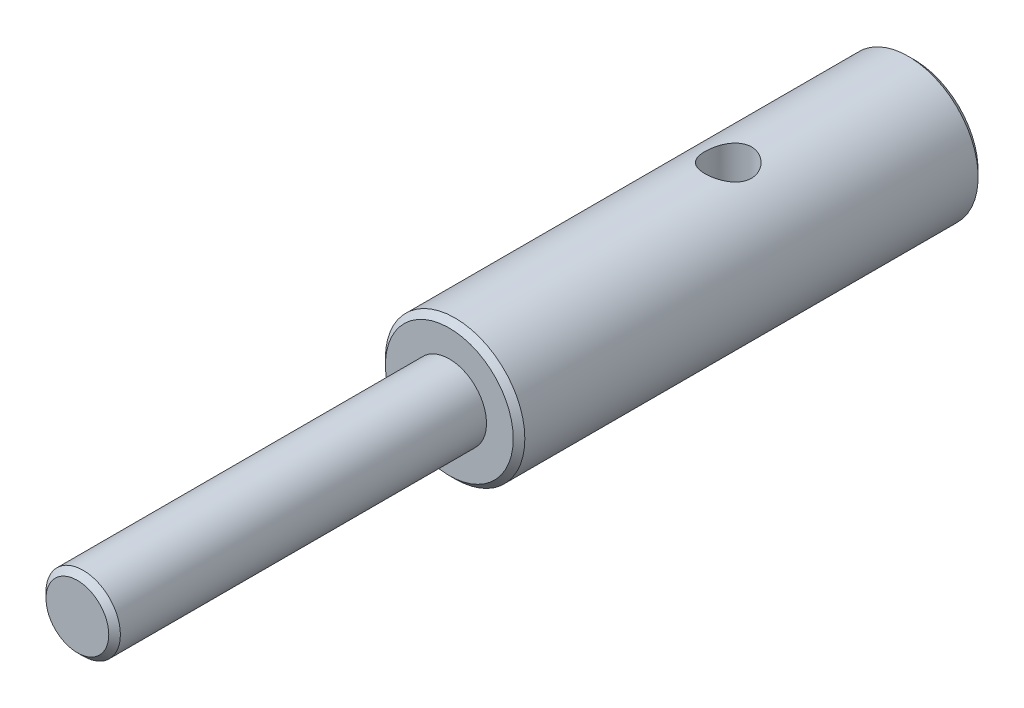
ISO-10303-21;
HEADER;
FILE_DESCRIPTION(('STEP AP214'),'2;1');
FILE_NAME('part.step','',(''),(''),'','','');
FILE_SCHEMA(('AUTOMOTIVE_DESIGN { 1 0 10303 214 1 1 1 1 }'));
ENDSEC;
DATA;
#1=APPLICATION_CONTEXT('core data for automotive mechanical design processes');
#2=APPLICATION_PROTOCOL_DEFINITION('international standard','automotive_design',2000,#1);
#3=PRODUCT_CONTEXT('',#1,'mechanical');
#4=PRODUCT('Part','Part','',(#3));
#5=PRODUCT_RELATED_PRODUCT_CATEGORY('part','',(#4));
#6=PRODUCT_DEFINITION_FORMATION('','',#4);
#7=PRODUCT_DEFINITION_CONTEXT('part definition',#1,'design');
#8=PRODUCT_DEFINITION('design','',#6,#7);
#9=PRODUCT_DEFINITION_SHAPE('','',#8);
#10=(LENGTH_UNIT() NAMED_UNIT(*) SI_UNIT(.MILLI.,.METRE.));
#11=(NAMED_UNIT(*) PLANE_ANGLE_UNIT() SI_UNIT($,.RADIAN.));
#12=(NAMED_UNIT(*) SI_UNIT($,.STERADIAN.) SOLID_ANGLE_UNIT());
#13=UNCERTAINTY_MEASURE_WITH_UNIT(LENGTH_MEASURE(1.E-05),#10,'distance_accuracy_value','');
#14=(GEOMETRIC_REPRESENTATION_CONTEXT(3) GLOBAL_UNCERTAINTY_ASSIGNED_CONTEXT((#13)) GLOBAL_UNIT_ASSIGNED_CONTEXT((#10,
#11,#12)) REPRESENTATION_CONTEXT('',''));
#15=CARTESIAN_POINT('',(0.,0.,0.));
#16=DIRECTION('',(0.,0.,1.));
#17=DIRECTION('',(1.,0.,0.));
#18=AXIS2_PLACEMENT_3D('',#15,#16,#17);
#19=CARTESIAN_POINT('',(0.,0.,0.));
#20=DIRECTION('',(0.,0.,-1.));
#21=DIRECTION('',(-1.,0.,0.));
#22=AXIS2_PLACEMENT_3D('',#19,#20,#21);
#23=CYLINDRICAL_SURFACE('',#22,3.);
#24=CARTESIAN_POINT('',(0.,0.,-9.75));
#25=DIRECTION('',(0.,0.,-1.));
#26=DIRECTION('',(-1.,0.,0.));
#27=AXIS2_PLACEMENT_3D('',#24,#25,#26);
#28=CIRCLE('',#27,3.);
#29=CARTESIAN_POINT('',(-3.,0.,-9.75));
#30=VERTEX_POINT('',#29);
#31=EDGE_CURVE('E48',#30,#30,#28,.F.);
#32=ORIENTED_EDGE('',*,*,#31,.T.);
#33=EDGE_LOOP('',(#32));
#34=FACE_BOUND('',#33,.T.);
#35=CARTESIAN_POINT('',(0.,0.,9.75));
#36=DIRECTION('',(0.,0.,1.));
#37=DIRECTION('',(1.,0.,0.));
#38=AXIS2_PLACEMENT_3D('',#35,#36,#37);
#39=CIRCLE('',#38,3.);
#40=CARTESIAN_POINT('',(3.,0.,9.75));
#41=VERTEX_POINT('',#40);
#42=EDGE_CURVE('E80',#41,#41,#39,.F.);
#43=ORIENTED_EDGE('',*,*,#42,.T.);
#44=EDGE_LOOP('',(#43));
#45=FACE_BOUND('',#44,.T.);
#46=CARTESIAN_POINT('',(0.,3.,-3.));
#47=CARTESIAN_POINT('',(0.0545633628867242,3.00000015300943,-3.00000025373164));
#48=CARTESIAN_POINT('',(0.109125194538551,2.99849769507545,-2.99551973387278));
#49=CARTESIAN_POINT('',(0.216641760872973,2.99265210203281,-2.97777089118278));
#50=CARTESIAN_POINT('',(0.269596328118819,2.98830867202153,-2.96450165605108));
#51=CARTESIAN_POINT('',(0.372332789501777,2.97725307906443,-2.92968075661595));
#52=CARTESIAN_POINT('',(0.422119825886035,2.97054487730853,-2.90814293754073));
#53=CARTESIAN_POINT('',(0.517374936805325,2.95544445717342,-2.85745882716165));
#54=CARTESIAN_POINT('',(0.562842156958706,2.94705190667778,-2.8283110349974));
#55=CARTESIAN_POINT('',(0.649741675022267,2.92914094443005,-2.76217419514125));
#56=CARTESIAN_POINT('',(0.69100370029831,2.91959556463785,-2.72496876573951));
#57=CARTESIAN_POINT('',(0.766832692702085,2.90060314783121,-2.64423284529343));
#58=CARTESIAN_POINT('',(0.801398185489463,2.89115613290549,-2.60070096507149));
#59=CARTESIAN_POINT('',(0.86382494222786,2.87313332477274,-2.50701488480354));
#60=CARTESIAN_POINT('',(0.891464858221033,2.86459039275688,-2.45670626026788));
#61=CARTESIAN_POINT('',(0.937818873877722,2.84975305418601,-2.35182390554145));
#62=CARTESIAN_POINT('',(0.956535697386766,2.84345796160746,-2.29725148283726));
#63=CARTESIAN_POINT('',(0.983873461509164,2.83411303269377,-2.18732677850329));
#64=CARTESIAN_POINT('',(0.99281344827177,2.83096095769611,-2.13206279151094));
#65=CARTESIAN_POINT('',(1.00134112333448,2.82795656629508,-2.02073624584412));
#66=CARTESIAN_POINT('',(1.00093170160472,2.8281032302273,-1.96467393929081));
#67=CARTESIAN_POINT('',(0.99101990370342,2.8315901500818,-1.85606336955598));
#68=CARTESIAN_POINT('',(0.981933913166996,2.83478415867533,-1.80347159708098));
#69=CARTESIAN_POINT('',(0.955606162849418,2.84376657724551,-1.70060658039317));
#70=CARTESIAN_POINT('',(0.938363426591872,2.84955529784108,-1.65033361456493));
#71=CARTESIAN_POINT('',(0.895939058060212,2.86317911131249,-1.55258725040852));
#72=CARTESIAN_POINT('',(0.870634048707264,2.87104565793117,-1.50517197453047));
#73=CARTESIAN_POINT('',(0.81288910630314,2.88792558575726,-1.41512909172027));
#74=CARTESIAN_POINT('',(0.780447112364007,2.89693929790464,-1.37250287306662));
#75=CARTESIAN_POINT('',(0.707349332682239,2.91567329167741,-1.29090840183923));
#76=CARTESIAN_POINT('',(0.666353150076313,2.92540589354843,-1.25224730549093));
#77=CARTESIAN_POINT('',(0.578339569970065,2.94406938387037,-1.1822687333366));
#78=CARTESIAN_POINT('',(0.531321595660816,2.95300019538067,-1.1509519618355));
#79=CARTESIAN_POINT('',(0.431947613046269,2.96917107937794,-1.09630369976493));
#80=CARTESIAN_POINT('',(0.379543276416338,2.97639350008039,-1.07305450865927));
#81=CARTESIAN_POINT('',(0.271269083364509,2.98820567144435,-1.03579682604429));
#82=CARTESIAN_POINT('',(0.215400438154955,2.99279633654878,-1.02178512457656));
#83=CARTESIAN_POINT('',(0.104383829529305,2.99867627071441,-1.00394433397764));
#84=CARTESIAN_POINT('',(0.0493095998648469,3.00010001833731,-0.999700190827251));
#85=CARTESIAN_POINT('',(-0.0607750699602348,2.99988902694825,-1.00033267359847));
#86=CARTESIAN_POINT('',(-0.115785519319645,2.99825480419352,-1.00520775997987));
#87=CARTESIAN_POINT('',(-0.222519866304258,2.99220024717114,-1.02361190773597));
#88=CARTESIAN_POINT('',(-0.274292806834855,2.98786198711228,-1.03688620604952));
#89=CARTESIAN_POINT('',(-0.374855958579559,2.97691846830034,-1.0713934444667));
#90=CARTESIAN_POINT('',(-0.423645788508558,2.97031292046541,-1.09262739946767));
#91=CARTESIAN_POINT('',(-0.51828829639332,2.95528931287427,-1.1430704318409));
#92=CARTESIAN_POINT('',(-0.564029959217328,2.94682814756305,-1.1724745932836));
#93=CARTESIAN_POINT('',(-0.650064830135403,2.92905253915743,-1.23819415001305));
#94=CARTESIAN_POINT('',(-0.690356367794893,2.91973783591888,-1.27451165603016));
#95=CARTESIAN_POINT('',(-0.766252507807012,2.90076847982472,-1.35497875100826));
#96=CARTESIAN_POINT('',(-0.80156096924849,2.89111761095155,-1.39940922693325));
#97=CARTESIAN_POINT('',(-0.864257522320852,2.87299973286981,-1.4937715678045));
#98=CARTESIAN_POINT('',(-0.891645547920842,2.8645327335312,-1.5437034786102));
#99=CARTESIAN_POINT('',(-0.937596930423359,2.84982391820308,-1.64767301530659));
#100=CARTESIAN_POINT('',(-0.956178132197765,2.84357760900632,-1.70170207924278));
#101=CARTESIAN_POINT('',(-0.983894666792162,2.83410832399133,-1.81237865012415));
#102=CARTESIAN_POINT('',(-0.993034254961242,2.83088398622698,-1.86902496543306));
#103=CARTESIAN_POINT('',(-1.00127628247038,2.82797858875071,-1.98019709601321));
#104=CARTESIAN_POINT('',(-1.00087025731093,2.82812400344299,-2.03468234025174));
#105=CARTESIAN_POINT('',(-0.991242293454877,2.8315126992356,-2.14276507489974));
#106=CARTESIAN_POINT('',(-0.982020879458886,2.83475579595884,-2.19636261795291));
#107=CARTESIAN_POINT('',(-0.95537181312698,2.84384524278943,-2.30013566301267));
#108=CARTESIAN_POINT('',(-0.938103346014879,2.84964098015514,-2.35035682500723));
#109=CARTESIAN_POINT('',(-0.895979365760381,2.86316398825434,-2.44722740693553));
#110=CARTESIAN_POINT('',(-0.871122168553978,2.87089168765297,-2.49387603118726));
#111=CARTESIAN_POINT('',(-0.813260692583248,2.8878282922406,-2.58448366992369));
#112=CARTESIAN_POINT('',(-0.779948242764531,2.89708711641604,-2.62823650189859));
#113=CARTESIAN_POINT('',(-0.706642883135696,2.91583356283786,-2.70968981338399));
#114=CARTESIAN_POINT('',(-0.666648084451494,2.92532124912518,-2.74738857568802));
#115=CARTESIAN_POINT('',(-0.579241556920673,2.94390030525393,-2.81714441228924));
#116=CARTESIAN_POINT('',(-0.531601513499724,2.95296181801216,-2.84892434775102));
#117=CARTESIAN_POINT('',(-0.431357357406628,2.96925991172652,-2.90399042885063));
#118=CARTESIAN_POINT('',(-0.378754518132349,2.9764969590794,-2.92727874592204));
#119=CARTESIAN_POINT('',(-0.272493647200975,2.98805515068532,-2.96372163248868));
#120=CARTESIAN_POINT('',(-0.218987757676408,2.9924921242252,-2.97728246626338));
#121=CARTESIAN_POINT('',(-0.110320416010247,2.99846407064225,-2.99542028067713));
#122=CARTESIAN_POINT('',(-0.0551594255687456,2.99999984531906,-2.99999974349654));
#123=CARTESIAN_POINT('',(0.,3.,-3.));
#124=B_SPLINE_CURVE_WITH_KNOTS('',3,(#46,#47,#48,#49,#50,#51,#52,#53,#54,#55,#56,#57,#58,#59,
#60,#61,#62,#63,#64,#65,#66,#67,#68,#69,#70,#71,#72,#73,#74,#75,#76,#77,#78,#79,#80,#81,#82,#83,
#84,#85,#86,#87,#88,#89,#90,#91,#92,#93,#94,#95,#96,#97,#98,#99,#100,#101,#102,#103,#104,#105,
#106,#107,#108,#109,#110,#111,#112,#113,#114,#115,#116,#117,#118,#119,#120,#121,#122,#123),
.UNSPECIFIED.,.T.,.F.,(4,2,2,2,2,2,2,2,2,2,2,2,2,2,2,2,2,2,2,2,2,2,2,2,2,2,2,2,2,2,2,2,2,2,2,2,
2,2,4),(0.,0.163487106026011,0.326991185267521,0.490222672870273,0.6534863777991,
0.82184684282756,0.990244332875302,1.1634838482347,1.33667044692833,1.5040192574184,
1.67131633987485,1.8309682655128,1.99063930855482,2.15288171155131,2.31517102558207,
2.48593305811367,2.65671145966618,2.82918405650357,3.00159668877208,3.1665358317517,
3.33144713164177,3.49158157978213,3.65173645284104,3.81610399843736,3.98052180821891,
4.15241022880752,4.32430008234997,4.49584013824416,4.66730284700846,4.82995666056619,
4.99260079341185,5.15215587070227,5.31174638165787,5.47830066681615,5.64490211113589,
5.8179966082491,5.99104681142266,6.15636558363623,6.3216386602795),.UNSPECIFIED.);
#125=CARTESIAN_POINT('',(0.,3.,-3.));
#126=VERTEX_POINT('',#125);
#127=EDGE_CURVE('E108',#126,#126,#124,.T.);
#128=ORIENTED_EDGE('',*,*,#127,.T.);
#129=EDGE_LOOP('',(#128));
#130=FACE_BOUND('',#129,.T.);
#131=ADVANCED_FACE('F39',(#34,#45,#130),#23,.T.);
#132=CARTESIAN_POINT('',(0.,0.,0.));
#133=DIRECTION('',(0.,0.,-1.));
#134=DIRECTION('',(-1.,0.,0.));
#135=AXIS2_PLACEMENT_3D('',#132,#133,#134);
#136=CYLINDRICAL_SURFACE('',#135,1.);
#137=CARTESIAN_POINT('',(0.,0.,0.));
#138=DIRECTION('',(0.,0.,-1.));
#139=DIRECTION('',(-1.,0.,0.));
#140=AXIS2_PLACEMENT_3D('',#137,#138,#139);
#141=CIRCLE('',#140,1.);
#142=CARTESIAN_POINT('',(-1.,0.,0.));
#143=VERTEX_POINT('',#142);
#144=EDGE_CURVE('E104',#143,#143,#141,.T.);
#145=ORIENTED_EDGE('',*,*,#144,.F.);
#146=EDGE_LOOP('',(#145));
#147=FACE_BOUND('',#146,.T.);
#148=CARTESIAN_POINT('',(0.,0.,-10.));
#149=DIRECTION('',(0.,0.,-1.));
#150=DIRECTION('',(-1.,0.,0.));
#151=AXIS2_PLACEMENT_3D('',#148,#149,#150);
#152=CIRCLE('',#151,1.);
#153=CARTESIAN_POINT('',(-1.,0.,-10.));
#154=VERTEX_POINT('',#153);
#155=EDGE_CURVE('E102',#154,#154,#152,.T.);
#156=ORIENTED_EDGE('',*,*,#155,.T.);
#157=EDGE_LOOP('',(#156));
#158=FACE_BOUND('',#157,.T.);
#159=CARTESIAN_POINT('',(0.,0.,-2.));
#160=DIRECTION('',(0.,0.707106781186547,-0.707106781186547));
#161=DIRECTION('',(0.,-0.707106781186547,-0.707106781186547));
#162=AXIS2_PLACEMENT_3D('',#159,#160,#161);
#163=ELLIPSE('',#162,1.41421356237309,1.);
#164=CARTESIAN_POINT('',(-1.,0.,-2.));
#165=VERTEX_POINT('',#164);
#166=CARTESIAN_POINT('',(1.,0.,-2.));
#167=VERTEX_POINT('',#166);
#168=EDGE_CURVE('E58',#165,#167,#163,.T.);
#169=ORIENTED_EDGE('',*,*,#168,.T.);
#170=CARTESIAN_POINT('',(0.,0.,-2.));
#171=DIRECTION('',(0.,-0.707106781186547,-0.707106781186547));
#172=DIRECTION('',(0.,0.707106781186547,-0.707106781186547));
#173=AXIS2_PLACEMENT_3D('',#170,#171,#172);
#174=ELLIPSE('',#173,1.41421356237309,1.);
#175=EDGE_CURVE('E56',#167,#165,#174,.F.);
#176=ORIENTED_EDGE('',*,*,#175,.T.);
#177=EDGE_LOOP('',(#169,#176));
#178=FACE_BOUND('',#177,.T.);
#179=ADVANCED_FACE('F64',(#147,#158,#178),#136,.F.);
#180=CARTESIAN_POINT('',(0.,1.,0.));
#181=DIRECTION('',(0.,0.,-1.));
#182=DIRECTION('',(-1.,0.,0.));
#183=AXIS2_PLACEMENT_3D('',#180,#181,#182);
#184=PLANE('',#183);
#185=ORIENTED_EDGE('',*,*,#144,.T.);
#186=EDGE_LOOP('',(#185));
#187=FACE_BOUND('',#186,.T.);
#188=ADVANCED_FACE('F123',(#187),#184,.T.);
#189=CARTESIAN_POINT('',(0.,0.,26.));
#190=DIRECTION('',(0.,0.,1.));
#191=DIRECTION('',(1.,0.,0.));
#192=AXIS2_PLACEMENT_3D('',#189,#190,#191);
#193=PLANE('',#192);
#194=CARTESIAN_POINT('',(0.,0.,26.));
#195=DIRECTION('',(0.,0.,1.));
#196=DIRECTION('',(1.,0.,0.));
#197=AXIS2_PLACEMENT_3D('',#194,#195,#196);
#198=CIRCLE('',#197,1.35);
#199=CARTESIAN_POINT('',(1.35,0.,26.));
#200=VERTEX_POINT('',#199);
#201=EDGE_CURVE('E70',#200,#200,#198,.T.);
#202=ORIENTED_EDGE('',*,*,#201,.T.);
#203=EDGE_LOOP('',(#202));
#204=FACE_BOUND('',#203,.T.);
#205=ADVANCED_FACE('F129',(#204),#193,.T.);
#206=CARTESIAN_POINT('',(0.,0.,0.));
#207=DIRECTION('',(0.,0.,-1.));
#208=DIRECTION('',(-1.,0.,0.));
#209=AXIS2_PLACEMENT_3D('',#206,#207,#208);
#210=CYLINDRICAL_SURFACE('',#209,1.6);
#211=CARTESIAN_POINT('',(0.,0.,25.75));
#212=DIRECTION('',(0.,0.,1.));
#213=DIRECTION('',(1.,0.,0.));
#214=AXIS2_PLACEMENT_3D('',#211,#212,#213);
#215=CIRCLE('',#214,1.6);
#216=CARTESIAN_POINT('',(1.6,0.,25.75));
#217=VERTEX_POINT('',#216);
#218=EDGE_CURVE('E66',#217,#217,#215,.F.);
#219=ORIENTED_EDGE('',*,*,#218,.T.);
#220=EDGE_LOOP('',(#219));
#221=FACE_BOUND('',#220,.T.);
#222=CARTESIAN_POINT('',(0.,0.,10.));
#223=DIRECTION('',(0.,0.,-1.));
#224=DIRECTION('',(-1.,0.,0.));
#225=AXIS2_PLACEMENT_3D('',#222,#223,#224);
#226=CIRCLE('',#225,1.6);
#227=CARTESIAN_POINT('',(-1.6,0.,10.));
#228=VERTEX_POINT('',#227);
#229=EDGE_CURVE('E62',#228,#228,#226,.T.);
#230=ORIENTED_EDGE('',*,*,#229,.F.);
#231=EDGE_LOOP('',(#230));
#232=FACE_BOUND('',#231,.T.);
#233=ADVANCED_FACE('F189',(#221,#232),#210,.T.);
#234=CARTESIAN_POINT('',(0.,1.6,10.));
#235=DIRECTION('',(0.,0.,1.));
#236=DIRECTION('',(1.,0.,0.));
#237=AXIS2_PLACEMENT_3D('',#234,#235,#236);
#238=PLANE('',#237);
#239=CARTESIAN_POINT('',(0.,0.,10.));
#240=DIRECTION('',(0.,0.,1.));
#241=DIRECTION('',(1.,0.,0.));
#242=AXIS2_PLACEMENT_3D('',#239,#240,#241);
#243=CIRCLE('',#242,2.75);
#244=CARTESIAN_POINT('',(2.75,0.,10.));
#245=VERTEX_POINT('',#244);
#246=EDGE_CURVE('E11',#245,#245,#243,.T.);
#247=ORIENTED_EDGE('',*,*,#246,.T.);
#248=EDGE_LOOP('',(#247));
#249=FACE_BOUND('',#248,.T.);
#250=ORIENTED_EDGE('',*,*,#229,.T.);
#251=EDGE_LOOP('',(#250));
#252=FACE_BOUND('',#251,.T.);
#253=ADVANCED_FACE('F98',(#249,#252),#238,.T.);
#254=CARTESIAN_POINT('',(0.,1.,-10.));
#255=DIRECTION('',(0.,0.,-1.));
#256=DIRECTION('',(-1.,0.,0.));
#257=AXIS2_PLACEMENT_3D('',#254,#255,#256);
#258=PLANE('',#257);
#259=CARTESIAN_POINT('',(0.,0.,-10.));
#260=DIRECTION('',(0.,0.,-1.));
#261=DIRECTION('',(-1.,0.,0.));
#262=AXIS2_PLACEMENT_3D('',#259,#260,#261);
#263=CIRCLE('',#262,2.75000000000001);
#264=CARTESIAN_POINT('',(-2.75000000000001,0.,-10.));
#265=VERTEX_POINT('',#264);
#266=EDGE_CURVE('E76',#265,#265,#263,.T.);
#267=ORIENTED_EDGE('',*,*,#266,.T.);
#268=EDGE_LOOP('',(#267));
#269=FACE_BOUND('',#268,.T.);
#270=ORIENTED_EDGE('',*,*,#155,.F.);
#271=EDGE_LOOP('',(#270));
#272=FACE_BOUND('',#271,.T.);
#273=ADVANCED_FACE('F95',(#269,#272),#258,.T.);
#274=CARTESIAN_POINT('',(0.,3.,-2.));
#275=DIRECTION('',(0.,-1.,0.));
#276=DIRECTION('',(0.,0.,-1.));
#277=AXIS2_PLACEMENT_3D('',#274,#275,#276);
#278=CYLINDRICAL_SURFACE('',#277,1.);
#279=ORIENTED_EDGE('',*,*,#127,.F.);
#280=EDGE_LOOP('',(#279));
#281=FACE_BOUND('',#280,.T.);
#282=ORIENTED_EDGE('',*,*,#168,.F.);
#283=ORIENTED_EDGE('',*,*,#175,.F.);
#284=EDGE_LOOP('',(#282,#283));
#285=FACE_BOUND('',#284,.T.);
#286=ADVANCED_FACE('F59',(#281,#285),#278,.F.);
#287=CARTESIAN_POINT('',(0.,0.,25.75));
#288=DIRECTION('',(0.,0.,-1.));
#289=DIRECTION('',(-1.,0.,0.));
#290=AXIS2_PLACEMENT_3D('',#287,#288,#289);
#291=CONICAL_SURFACE('',#290,1.6,0.785398163397442);
#292=ORIENTED_EDGE('',*,*,#201,.F.);
#293=EDGE_LOOP('',(#292));
#294=FACE_BOUND('',#293,.T.);
#295=ORIENTED_EDGE('',*,*,#218,.F.);
#296=EDGE_LOOP('',(#295));
#297=FACE_BOUND('',#296,.T.);
#298=ADVANCED_FACE('F92',(#294,#297),#291,.T.);
#299=CARTESIAN_POINT('',(0.,0.,-10.));
#300=DIRECTION('',(0.,0.,1.));
#301=DIRECTION('',(1.,0.,0.));
#302=AXIS2_PLACEMENT_3D('',#299,#300,#301);
#303=CONICAL_SURFACE('',#302,2.75000000000001,0.785398163397441);
#304=ORIENTED_EDGE('',*,*,#31,.F.);
#305=EDGE_LOOP('',(#304));
#306=FACE_BOUND('',#305,.T.);
#307=ORIENTED_EDGE('',*,*,#266,.F.);
#308=EDGE_LOOP('',(#307));
#309=FACE_BOUND('',#308,.T.);
#310=ADVANCED_FACE('F89',(#306,#309),#303,.T.);
#311=CARTESIAN_POINT('',(0.,0.,9.75));
#312=DIRECTION('',(0.,0.,-1.));
#313=DIRECTION('',(-1.,0.,0.));
#314=AXIS2_PLACEMENT_3D('',#311,#312,#313);
#315=CONICAL_SURFACE('',#314,3.,0.785398163397453);
#316=ORIENTED_EDGE('',*,*,#246,.F.);
#317=EDGE_LOOP('',(#316));
#318=FACE_BOUND('',#317,.T.);
#319=ORIENTED_EDGE('',*,*,#42,.F.);
#320=EDGE_LOOP('',(#319));
#321=FACE_BOUND('',#320,.T.);
#322=ADVANCED_FACE('F41',(#318,#321),#315,.T.);
#323=CLOSED_SHELL('',(#131,#179,#188,#205,#233,#253,#273,#286,#298,#310,#322));
#324=MANIFOLD_SOLID_BREP('B2',#323);
#325=ADVANCED_BREP_SHAPE_REPRESENTATION('',(#18,#324),#14);
#326=SHAPE_DEFINITION_REPRESENTATION(#9,#325);
ENDSEC;
END-ISO-10303-21;
